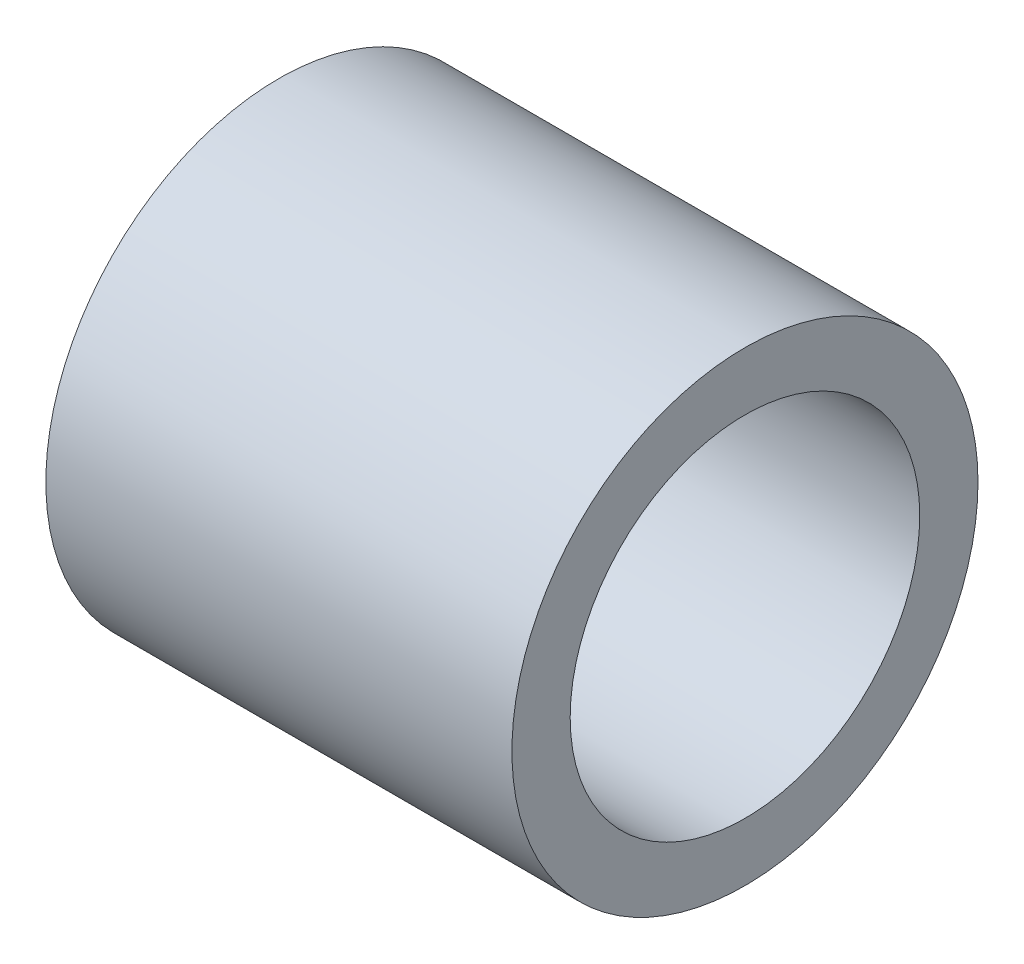
ISO-10303-21;
HEADER;
FILE_DESCRIPTION(('STEP AP214'),'2;1');
FILE_NAME('part.step','',(''),(''),'','','');
FILE_SCHEMA(('AUTOMOTIVE_DESIGN { 1 0 10303 214 1 1 1 1 }'));
ENDSEC;
DATA;
#1=APPLICATION_CONTEXT('core data for automotive mechanical design processes');
#2=APPLICATION_PROTOCOL_DEFINITION('international standard','automotive_design',2000,#1);
#3=PRODUCT_CONTEXT('',#1,'mechanical');
#4=PRODUCT('Part','Part','',(#3));
#5=PRODUCT_RELATED_PRODUCT_CATEGORY('part','',(#4));
#6=PRODUCT_DEFINITION_FORMATION('','',#4);
#7=PRODUCT_DEFINITION_CONTEXT('part definition',#1,'design');
#8=PRODUCT_DEFINITION('design','',#6,#7);
#9=PRODUCT_DEFINITION_SHAPE('','',#8);
#10=(LENGTH_UNIT() NAMED_UNIT(*) SI_UNIT(.MILLI.,.METRE.));
#11=(NAMED_UNIT(*) PLANE_ANGLE_UNIT() SI_UNIT($,.RADIAN.));
#12=(NAMED_UNIT(*) SI_UNIT($,.STERADIAN.) SOLID_ANGLE_UNIT());
#13=UNCERTAINTY_MEASURE_WITH_UNIT(LENGTH_MEASURE(1.E-05),#10,'distance_accuracy_value','');
#14=(GEOMETRIC_REPRESENTATION_CONTEXT(3) GLOBAL_UNCERTAINTY_ASSIGNED_CONTEXT((#13)) GLOBAL_UNIT_ASSIGNED_CONTEXT((#10,
#11,#12)) REPRESENTATION_CONTEXT('',''));
#15=CARTESIAN_POINT('',(0.,0.,0.));
#16=DIRECTION('',(0.,0.,1.));
#17=DIRECTION('',(1.,0.,0.));
#18=AXIS2_PLACEMENT_3D('',#15,#16,#17);
#19=CARTESIAN_POINT('',(12.7,0.,0.));
#20=DIRECTION('',(1.,0.,0.));
#21=DIRECTION('',(0.,0.,-1.));
#22=AXIS2_PLACEMENT_3D('',#19,#20,#21);
#23=PLANE('',#22);
#24=CARTESIAN_POINT('',(12.7,0.,0.));
#25=DIRECTION('',(1.,0.,0.));
#26=DIRECTION('',(0.,0.,-1.));
#27=AXIS2_PLACEMENT_3D('',#24,#25,#26);
#28=CIRCLE('',#27,12.7);
#29=CARTESIAN_POINT('',(12.7,0.,-12.7));
#30=VERTEX_POINT('',#29);
#31=EDGE_CURVE('E10',#30,#30,#28,.T.);
#32=ORIENTED_EDGE('',*,*,#31,.T.);
#33=EDGE_LOOP('',(#32));
#34=FACE_BOUND('',#33,.T.);
#35=CARTESIAN_POINT('',(12.7,0.,0.));
#36=DIRECTION('',(1.,0.,0.));
#37=DIRECTION('',(0.,0.,-1.));
#38=AXIS2_PLACEMENT_3D('',#35,#36,#37);
#39=CIRCLE('',#38,9.525);
#40=CARTESIAN_POINT('',(12.7,0.,-9.525));
#41=VERTEX_POINT('',#40);
#42=EDGE_CURVE('E46',#41,#41,#39,.T.);
#43=ORIENTED_EDGE('',*,*,#42,.F.);
#44=EDGE_LOOP('',(#43));
#45=FACE_BOUND('',#44,.T.);
#46=ADVANCED_FACE('F35',(#34,#45),#23,.T.);
#47=CARTESIAN_POINT('',(-12.7,0.,0.));
#48=DIRECTION('',(1.,0.,0.));
#49=DIRECTION('',(0.,0.,-1.));
#50=AXIS2_PLACEMENT_3D('',#47,#48,#49);
#51=PLANE('',#50);
#52=CARTESIAN_POINT('',(-12.7,0.,0.));
#53=DIRECTION('',(1.,0.,0.));
#54=DIRECTION('',(0.,0.,-1.));
#55=AXIS2_PLACEMENT_3D('',#52,#53,#54);
#56=CIRCLE('',#55,12.7);
#57=CARTESIAN_POINT('',(-12.7,0.,-12.7));
#58=VERTEX_POINT('',#57);
#59=EDGE_CURVE('E39',#58,#58,#56,.T.);
#60=ORIENTED_EDGE('',*,*,#59,.F.);
#61=EDGE_LOOP('',(#60));
#62=FACE_BOUND('',#61,.T.);
#63=CARTESIAN_POINT('',(-12.7,0.,0.));
#64=DIRECTION('',(1.,0.,0.));
#65=DIRECTION('',(0.,0.,-1.));
#66=AXIS2_PLACEMENT_3D('',#63,#64,#65);
#67=CIRCLE('',#66,9.525);
#68=CARTESIAN_POINT('',(-12.7,0.,-9.525));
#69=VERTEX_POINT('',#68);
#70=EDGE_CURVE('E48',#69,#69,#67,.T.);
#71=ORIENTED_EDGE('',*,*,#70,.T.);
#72=EDGE_LOOP('',(#71));
#73=FACE_BOUND('',#72,.T.);
#74=ADVANCED_FACE('F58',(#62,#73),#51,.F.);
#75=CARTESIAN_POINT('',(12.7,0.,0.));
#76=DIRECTION('',(-1.,0.,0.));
#77=DIRECTION('',(0.,0.,1.));
#78=AXIS2_PLACEMENT_3D('',#75,#76,#77);
#79=CYLINDRICAL_SURFACE('',#78,12.7);
#80=ORIENTED_EDGE('',*,*,#31,.F.);
#81=EDGE_LOOP('',(#80));
#82=FACE_BOUND('',#81,.T.);
#83=ORIENTED_EDGE('',*,*,#59,.T.);
#84=EDGE_LOOP('',(#83));
#85=FACE_BOUND('',#84,.T.);
#86=ADVANCED_FACE('F37',(#82,#85),#79,.T.);
#87=CARTESIAN_POINT('',(12.7,0.,0.));
#88=DIRECTION('',(-1.,0.,0.));
#89=DIRECTION('',(0.,0.,1.));
#90=AXIS2_PLACEMENT_3D('',#87,#88,#89);
#91=CYLINDRICAL_SURFACE('',#90,9.525);
#92=ORIENTED_EDGE('',*,*,#42,.T.);
#93=EDGE_LOOP('',(#92));
#94=FACE_BOUND('',#93,.T.);
#95=ORIENTED_EDGE('',*,*,#70,.F.);
#96=EDGE_LOOP('',(#95));
#97=FACE_BOUND('',#96,.T.);
#98=ADVANCED_FACE('F54',(#94,#97),#91,.F.);
#99=CLOSED_SHELL('',(#46,#74,#86,#98));
#100=MANIFOLD_SOLID_BREP('B2',#99);
#101=ADVANCED_BREP_SHAPE_REPRESENTATION('',(#18,#100),#14);
#102=SHAPE_DEFINITION_REPRESENTATION(#9,#101);
ENDSEC;
END-ISO-10303-21;
